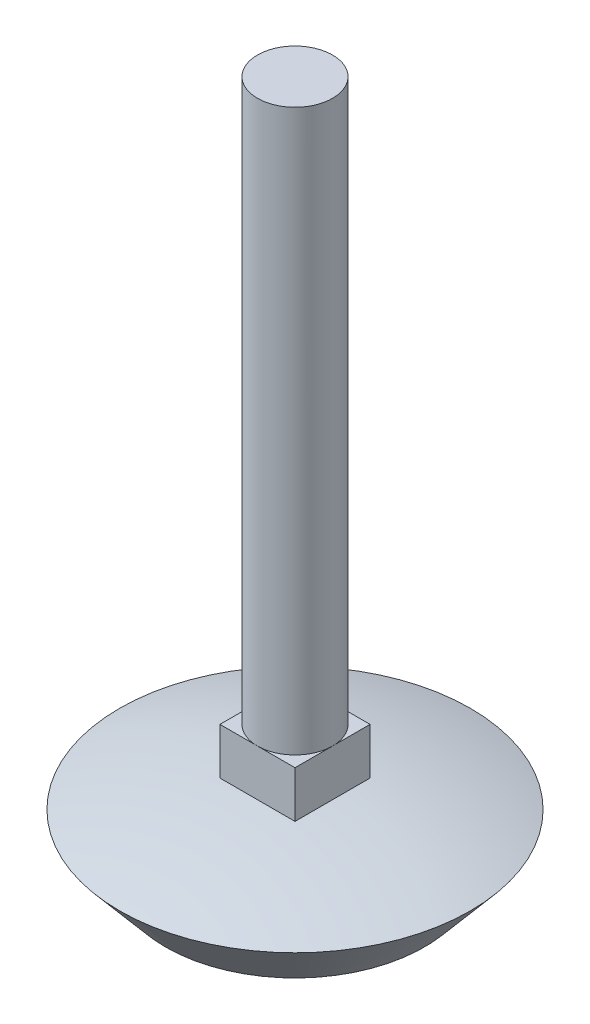
ISO-10303-21;
HEADER;
FILE_DESCRIPTION(('STEP AP214'),'2;1');
FILE_NAME('part.step','',(''),(''),'','','');
FILE_SCHEMA(('AUTOMOTIVE_DESIGN { 1 0 10303 214 1 1 1 1 }'));
ENDSEC;
DATA;
#1=APPLICATION_CONTEXT('core data for automotive mechanical design processes');
#2=APPLICATION_PROTOCOL_DEFINITION('international standard','automotive_design',2000,#1);
#3=PRODUCT_CONTEXT('',#1,'mechanical');
#4=PRODUCT('Part','Part','',(#3));
#5=PRODUCT_RELATED_PRODUCT_CATEGORY('part','',(#4));
#6=PRODUCT_DEFINITION_FORMATION('','',#4);
#7=PRODUCT_DEFINITION_CONTEXT('part definition',#1,'design');
#8=PRODUCT_DEFINITION('design','',#6,#7);
#9=PRODUCT_DEFINITION_SHAPE('','',#8);
#10=(LENGTH_UNIT() NAMED_UNIT(*) SI_UNIT(.MILLI.,.METRE.));
#11=(NAMED_UNIT(*) PLANE_ANGLE_UNIT() SI_UNIT($,.RADIAN.));
#12=(NAMED_UNIT(*) SI_UNIT($,.STERADIAN.) SOLID_ANGLE_UNIT());
#13=UNCERTAINTY_MEASURE_WITH_UNIT(LENGTH_MEASURE(1.E-05),#10,'distance_accuracy_value','');
#14=(GEOMETRIC_REPRESENTATION_CONTEXT(3) GLOBAL_UNCERTAINTY_ASSIGNED_CONTEXT((#13)) GLOBAL_UNIT_ASSIGNED_CONTEXT((#10,
#11,#12)) REPRESENTATION_CONTEXT('',''));
#15=CARTESIAN_POINT('',(0.,0.,0.));
#16=DIRECTION('',(0.,0.,1.));
#17=DIRECTION('',(1.,0.,0.));
#18=AXIS2_PLACEMENT_3D('',#15,#16,#17);
#19=CARTESIAN_POINT('',(152.400000006924,794.888474618777,0.));
#20=DIRECTION('',(0.,1.,0.));
#21=DIRECTION('',(-1.,0.,0.));
#22=AXIS2_PLACEMENT_3D('',#19,#20,#21);
#23=SPHERICAL_SURFACE('',#22,68.8702857354274);
#24=CARTESIAN_POINT('',(152.4,860.20276035304,0.));
#25=DIRECTION('',(0.,1.,0.));
#26=DIRECTION('',(0.,0.,1.));
#27=AXIS2_PLACEMENT_3D('',#24,#25,#26);
#28=CIRCLE('',#27,21.844);
#29=CARTESIAN_POINT('',(152.4,860.20276035304,21.844));
#30=VERTEX_POINT('',#29);
#31=EDGE_CURVE('E135',#30,#30,#28,.T.);
#32=ORIENTED_EDGE('',*,*,#31,.T.);
#33=EDGE_LOOP('',(#32));
#34=FACE_BOUND('',#33,.T.);
#35=CARTESIAN_POINT('',(152.4,863.600000000368,0.));
#36=DIRECTION('',(0.,1.,0.));
#37=DIRECTION('',(0.,0.,1.));
#38=AXIS2_PLACEMENT_3D('',#35,#36,#37);
#39=CIRCLE('',#38,4.67359999890013);
#40=CARTESIAN_POINT('',(152.4,863.600000000602,4.6736));
#41=VERTEX_POINT('',#40);
#42=CARTESIAN_POINT('',(157.0735999989,863.600000000368,0.));
#43=VERTEX_POINT('',#42);
#44=EDGE_CURVE('E120',#41,#43,#39,.T.);
#45=ORIENTED_EDGE('',*,*,#44,.F.);
#46=CARTESIAN_POINT('',(147.7264000011,863.600000000368,0.));
#47=VERTEX_POINT('',#46);
#48=EDGE_CURVE('E54',#47,#41,#39,.T.);
#49=ORIENTED_EDGE('',*,*,#48,.F.);
#50=CARTESIAN_POINT('',(152.4,863.600000000368,-4.67359999890013));
#51=VERTEX_POINT('',#50);
#52=EDGE_CURVE('E124',#51,#47,#39,.T.);
#53=ORIENTED_EDGE('',*,*,#52,.F.);
#54=EDGE_CURVE('E130',#43,#51,#39,.T.);
#55=ORIENTED_EDGE('',*,*,#54,.F.);
#56=EDGE_LOOP('',(#45,#49,#53,#55));
#57=FACE_BOUND('',#56,.T.);
#58=ADVANCED_FACE('F31',(#34,#57),#23,.T.);
#59=CARTESIAN_POINT('',(152.4,860.20276035304,0.));
#60=DIRECTION('',(0.,1.,0.));
#61=DIRECTION('',(0.,0.,1.));
#62=AXIS2_PLACEMENT_3D('',#59,#60,#61);
#63=CONICAL_SURFACE('',#62,21.844,0.701624464926902);
#64=CARTESIAN_POINT('',(152.4,853.44,0.));
#65=DIRECTION('',(0.,1.,0.));
#66=DIRECTION('',(0.,0.,1.));
#67=AXIS2_PLACEMENT_3D('',#64,#65,#66);
#68=CIRCLE('',#67,16.129);
#69=CARTESIAN_POINT('',(152.4,853.44,16.129));
#70=VERTEX_POINT('',#69);
#71=EDGE_CURVE('E133',#70,#70,#68,.T.);
#72=ORIENTED_EDGE('',*,*,#71,.T.);
#73=EDGE_LOOP('',(#72));
#74=FACE_BOUND('',#73,.T.);
#75=ORIENTED_EDGE('',*,*,#31,.F.);
#76=EDGE_LOOP('',(#75));
#77=FACE_BOUND('',#76,.T.);
#78=ADVANCED_FACE('F207',(#74,#77),#63,.T.);
#79=CARTESIAN_POINT('',(152.4,853.44,0.));
#80=DIRECTION('',(0.,-1.,0.));
#81=DIRECTION('',(0.,0.,-1.));
#82=AXIS2_PLACEMENT_3D('',#79,#80,#81);
#83=PLANE('',#82);
#84=ORIENTED_EDGE('',*,*,#71,.F.);
#85=EDGE_LOOP('',(#84));
#86=FACE_BOUND('',#85,.T.);
#87=ADVANCED_FACE('F203',(#86),#83,.T.);
#88=CARTESIAN_POINT('',(147.7264000011,863.600000000368,4.6736));
#89=DIRECTION('',(-5.01591046581465E-11,1.,0.));
#90=DIRECTION('',(-1.,-5.01591046581465E-11,0.));
#91=AXIS2_PLACEMENT_3D('',#88,#89,#90);
#92=PLANE('',#91);
#93=ORIENTED_EDGE('',*,*,#52,.T.);
#94=DIRECTION('',(0.,0.,-1.));
#95=VECTOR('',#94,1.);
#96=CARTESIAN_POINT('',(147.7264000011,863.600000000368,4.6736));
#97=LINE('',#96,#95);
#98=CARTESIAN_POINT('',(147.7264000011,863.600000000368,-4.6736));
#99=VERTEX_POINT('',#98);
#100=EDGE_CURVE('E170',#47,#99,#97,.T.);
#101=ORIENTED_EDGE('',*,*,#100,.T.);
#102=DIRECTION('',(1.,5.01591046581465E-11,0.));
#103=VECTOR('',#102,1.);
#104=CARTESIAN_POINT('',(147.7264000011,863.600000000368,-4.6736));
#105=LINE('',#104,#103);
#106=EDGE_CURVE('E176',#99,#51,#105,.T.);
#107=ORIENTED_EDGE('',*,*,#106,.T.);
#108=EDGE_LOOP('',(#93,#101,#107));
#109=FACE_BOUND('',#108,.T.);
#110=ADVANCED_FACE('F189',(#109),#92,.F.);
#111=ORIENTED_EDGE('',*,*,#54,.T.);
#112=CARTESIAN_POINT('',(157.073600005856,863.600000000837,-4.6736));
#113=VERTEX_POINT('',#112);
#114=EDGE_CURVE('E179',#51,#113,#105,.T.);
#115=ORIENTED_EDGE('',*,*,#114,.T.);
#116=DIRECTION('',(0.,0.,-1.));
#117=VECTOR('',#116,1.);
#118=CARTESIAN_POINT('',(157.073600005856,863.600000000837,4.6736));
#119=LINE('',#118,#117);
#120=EDGE_CURVE('E122',#43,#113,#119,.T.);
#121=ORIENTED_EDGE('',*,*,#120,.F.);
#122=EDGE_LOOP('',(#111,#115,#121));
#123=FACE_BOUND('',#122,.T.);
#124=ADVANCED_FACE('F202',(#123),#92,.F.);
#125=ORIENTED_EDGE('',*,*,#44,.T.);
#126=CARTESIAN_POINT('',(157.073600005856,863.600000000837,4.6736));
#127=VERTEX_POINT('',#126);
#128=EDGE_CURVE('E113',#127,#43,#119,.T.);
#129=ORIENTED_EDGE('',*,*,#128,.F.);
#130=DIRECTION('',(1.,5.01591046581465E-11,0.));
#131=VECTOR('',#130,1.);
#132=CARTESIAN_POINT('',(147.7264000011,863.600000000368,4.6736));
#133=LINE('',#132,#131);
#134=EDGE_CURVE('E96',#41,#127,#133,.T.);
#135=ORIENTED_EDGE('',*,*,#134,.F.);
#136=EDGE_LOOP('',(#125,#129,#135));
#137=FACE_BOUND('',#136,.T.);
#138=ADVANCED_FACE('F119',(#137),#92,.F.);
#139=CARTESIAN_POINT('',(157.073600005856,863.600000000837,4.6736));
#140=DIRECTION('',(-1.,-1.2011312576063E-09,0.));
#141=DIRECTION('',(1.2011312576063E-09,-1.,0.));
#142=AXIS2_PLACEMENT_3D('',#139,#140,#141);
#143=PLANE('',#142);
#144=DIRECTION('',(0.,0.,-1.));
#145=VECTOR('',#144,1.);
#146=CARTESIAN_POINT('',(157.0735999989,869.391200000368,4.6736));
#147=LINE('',#146,#145);
#148=CARTESIAN_POINT('',(157.0735999989,869.391200000368,0.));
#149=VERTEX_POINT('',#148);
#150=CARTESIAN_POINT('',(157.0735999989,869.391200000368,-4.6736));
#151=VERTEX_POINT('',#150);
#152=EDGE_CURVE('E166',#149,#151,#147,.T.);
#153=ORIENTED_EDGE('',*,*,#152,.F.);
#154=CARTESIAN_POINT('',(157.0735999989,869.391200000368,4.6736));
#155=VERTEX_POINT('',#154);
#156=EDGE_CURVE('E115',#155,#149,#147,.T.);
#157=ORIENTED_EDGE('',*,*,#156,.F.);
#158=DIRECTION('',(-1.2011312576063E-09,1.,0.));
#159=VECTOR('',#158,1.);
#160=CARTESIAN_POINT('',(157.073600005856,863.600000000837,4.6736));
#161=LINE('',#160,#159);
#162=EDGE_CURVE('E100',#127,#155,#161,.T.);
#163=ORIENTED_EDGE('',*,*,#162,.F.);
#164=ORIENTED_EDGE('',*,*,#128,.T.);
#165=ORIENTED_EDGE('',*,*,#120,.T.);
#166=DIRECTION('',(-1.2011312576063E-09,1.,0.));
#167=VECTOR('',#166,1.);
#168=CARTESIAN_POINT('',(157.073600005856,863.600000000837,-4.6736));
#169=LINE('',#168,#167);
#170=EDGE_CURVE('E173',#113,#151,#169,.T.);
#171=ORIENTED_EDGE('',*,*,#170,.T.);
#172=EDGE_LOOP('',(#153,#157,#163,#164,#165,#171));
#173=FACE_BOUND('',#172,.T.);
#174=ADVANCED_FACE('F112',(#173),#143,.F.);
#175=CARTESIAN_POINT('',(157.0735999989,869.391200000368,4.6736));
#176=DIRECTION('',(0.,-1.,0.));
#177=DIRECTION('',(0.,0.,-1.));
#178=AXIS2_PLACEMENT_3D('',#175,#176,#177);
#179=PLANE('',#178);
#180=CARTESIAN_POINT('',(152.4,869.391200000368,0.));
#181=DIRECTION('',(0.,-1.,0.));
#182=DIRECTION('',(0.,0.,-1.));
#183=AXIS2_PLACEMENT_3D('',#180,#181,#182);
#184=CIRCLE('',#183,4.67359999890013);
#185=CARTESIAN_POINT('',(152.4,869.391200000368,-4.67359999945007));
#186=VERTEX_POINT('',#185);
#187=CARTESIAN_POINT('',(147.7264000011,869.391200000368,0.));
#188=VERTEX_POINT('',#187);
#189=EDGE_CURVE('E11',#186,#188,#184,.F.);
#190=ORIENTED_EDGE('',*,*,#189,.F.);
#191=DIRECTION('',(-1.,0.,0.));
#192=VECTOR('',#191,1.);
#193=CARTESIAN_POINT('',(157.0735999989,869.391200000368,-4.6736));
#194=LINE('',#193,#192);
#195=CARTESIAN_POINT('',(147.7264000011,869.391200000368,-4.6736));
#196=VERTEX_POINT('',#195);
#197=EDGE_CURVE('E158',#186,#196,#194,.T.);
#198=ORIENTED_EDGE('',*,*,#197,.T.);
#199=DIRECTION('',(0.,0.,-1.));
#200=VECTOR('',#199,1.);
#201=CARTESIAN_POINT('',(147.7264000011,869.391200000368,4.6736));
#202=LINE('',#201,#200);
#203=EDGE_CURVE('E156',#188,#196,#202,.T.);
#204=ORIENTED_EDGE('',*,*,#203,.F.);
#205=EDGE_LOOP('',(#190,#198,#204));
#206=FACE_BOUND('',#205,.T.);
#207=ADVANCED_FACE('F157',(#206),#179,.F.);
#208=CARTESIAN_POINT('',(152.4,869.391200000368,4.6736));
#209=VERTEX_POINT('',#208);
#210=EDGE_CURVE('E39',#188,#209,#184,.F.);
#211=ORIENTED_EDGE('',*,*,#210,.F.);
#212=CARTESIAN_POINT('',(147.7264000011,869.391200000368,4.6736));
#213=VERTEX_POINT('',#212);
#214=EDGE_CURVE('E152',#213,#188,#202,.T.);
#215=ORIENTED_EDGE('',*,*,#214,.F.);
#216=DIRECTION('',(-1.,0.,0.));
#217=VECTOR('',#216,1.);
#218=CARTESIAN_POINT('',(157.0735999989,869.391200000368,4.6736));
#219=LINE('',#218,#217);
#220=EDGE_CURVE('E117',#209,#213,#219,.T.);
#221=ORIENTED_EDGE('',*,*,#220,.F.);
#222=EDGE_LOOP('',(#211,#215,#221));
#223=FACE_BOUND('',#222,.T.);
#224=ADVANCED_FACE('F150',(#223),#179,.F.);
#225=EDGE_CURVE('E140',#209,#149,#184,.F.);
#226=ORIENTED_EDGE('',*,*,#225,.F.);
#227=EDGE_CURVE('E181',#155,#209,#219,.T.);
#228=ORIENTED_EDGE('',*,*,#227,.F.);
#229=ORIENTED_EDGE('',*,*,#156,.T.);
#230=EDGE_LOOP('',(#226,#228,#229));
#231=FACE_BOUND('',#230,.T.);
#232=ADVANCED_FACE('F196',(#231),#179,.F.);
#233=CARTESIAN_POINT('',(147.7264000011,869.391200000368,4.6736));
#234=DIRECTION('',(1.,0.,0.));
#235=DIRECTION('',(0.,1.,0.));
#236=AXIS2_PLACEMENT_3D('',#233,#234,#235);
#237=PLANE('',#236);
#238=ORIENTED_EDGE('',*,*,#214,.T.);
#239=ORIENTED_EDGE('',*,*,#203,.T.);
#240=DIRECTION('',(0.,-1.,0.));
#241=VECTOR('',#240,1.);
#242=CARTESIAN_POINT('',(147.7264000011,869.391200000368,-4.6736));
#243=LINE('',#242,#241);
#244=EDGE_CURVE('E107',#196,#99,#243,.T.);
#245=ORIENTED_EDGE('',*,*,#244,.T.);
#246=ORIENTED_EDGE('',*,*,#100,.F.);
#247=CARTESIAN_POINT('',(147.7264000011,863.600000000368,4.6736));
#248=VERTEX_POINT('',#247);
#249=EDGE_CURVE('E162',#248,#47,#97,.T.);
#250=ORIENTED_EDGE('',*,*,#249,.F.);
#251=DIRECTION('',(0.,-1.,0.));
#252=VECTOR('',#251,1.);
#253=CARTESIAN_POINT('',(147.7264000011,869.391200000368,4.6736));
#254=LINE('',#253,#252);
#255=EDGE_CURVE('E165',#213,#248,#254,.T.);
#256=ORIENTED_EDGE('',*,*,#255,.F.);
#257=EDGE_LOOP('',(#238,#239,#245,#246,#250,#256));
#258=FACE_BOUND('',#257,.T.);
#259=ADVANCED_FACE('F163',(#258),#237,.F.);
#260=CARTESIAN_POINT('',(147.7264000011,863.600000000368,4.6736));
#261=DIRECTION('',(0.,0.,-1.));
#262=DIRECTION('',(-1.,0.,0.));
#263=AXIS2_PLACEMENT_3D('',#260,#261,#262);
#264=PLANE('',#263);
#265=ORIENTED_EDGE('',*,*,#227,.T.);
#266=ORIENTED_EDGE('',*,*,#220,.T.);
#267=ORIENTED_EDGE('',*,*,#255,.T.);
#268=EDGE_CURVE('E103',#248,#41,#133,.T.);
#269=ORIENTED_EDGE('',*,*,#268,.T.);
#270=ORIENTED_EDGE('',*,*,#134,.T.);
#271=ORIENTED_EDGE('',*,*,#162,.T.);
#272=EDGE_LOOP('',(#265,#266,#267,#269,#270,#271));
#273=FACE_BOUND('',#272,.T.);
#274=ADVANCED_FACE('F99',(#273),#264,.F.);
#275=CARTESIAN_POINT('',(147.7264000011,863.600000000368,-4.6736));
#276=DIRECTION('',(0.,0.,-1.));
#277=DIRECTION('',(-1.,0.,0.));
#278=AXIS2_PLACEMENT_3D('',#275,#276,#277);
#279=PLANE('',#278);
#280=ORIENTED_EDGE('',*,*,#114,.F.);
#281=ORIENTED_EDGE('',*,*,#106,.F.);
#282=ORIENTED_EDGE('',*,*,#244,.F.);
#283=ORIENTED_EDGE('',*,*,#197,.F.);
#284=EDGE_CURVE('E46',#151,#186,#194,.T.);
#285=ORIENTED_EDGE('',*,*,#284,.F.);
#286=ORIENTED_EDGE('',*,*,#170,.F.);
#287=EDGE_LOOP('',(#280,#281,#282,#283,#285,#286));
#288=FACE_BOUND('',#287,.T.);
#289=ADVANCED_FACE('F187',(#288),#279,.T.);
#290=ORIENTED_EDGE('',*,*,#48,.T.);
#291=ORIENTED_EDGE('',*,*,#268,.F.);
#292=ORIENTED_EDGE('',*,*,#249,.T.);
#293=EDGE_LOOP('',(#290,#291,#292));
#294=FACE_BOUND('',#293,.T.);
#295=ADVANCED_FACE('F184',(#294),#92,.F.);
#296=EDGE_CURVE('E34',#149,#186,#184,.F.);
#297=ORIENTED_EDGE('',*,*,#296,.F.);
#298=ORIENTED_EDGE('',*,*,#152,.T.);
#299=ORIENTED_EDGE('',*,*,#284,.T.);
#300=EDGE_LOOP('',(#297,#298,#299));
#301=FACE_BOUND('',#300,.T.);
#302=ADVANCED_FACE('F186',(#301),#179,.F.);
#303=CARTESIAN_POINT('',(152.4,939.241200000368,0.));
#304=DIRECTION('',(0.,1.,0.));
#305=DIRECTION('',(0.,0.,1.));
#306=AXIS2_PLACEMENT_3D('',#303,#304,#305);
#307=PLANE('',#306);
#308=CARTESIAN_POINT('',(152.4,939.241200000368,0.));
#309=DIRECTION('',(0.,1.,0.));
#310=DIRECTION('',(0.,0.,1.));
#311=AXIS2_PLACEMENT_3D('',#308,#309,#310);
#312=CIRCLE('',#311,4.67359999890013);
#313=CARTESIAN_POINT('',(152.4,939.241200000368,4.67359999890013));
#314=VERTEX_POINT('',#313);
#315=EDGE_CURVE('E129',#314,#314,#312,.T.);
#316=ORIENTED_EDGE('',*,*,#315,.T.);
#317=EDGE_LOOP('',(#316));
#318=FACE_BOUND('',#317,.T.);
#319=ADVANCED_FACE('F194',(#318),#307,.T.);
#320=CARTESIAN_POINT('',(152.4,939.241200000368,0.));
#321=DIRECTION('',(0.,1.,0.));
#322=DIRECTION('',(0.,0.,1.));
#323=AXIS2_PLACEMENT_3D('',#320,#321,#322);
#324=CYLINDRICAL_SURFACE('',#323,4.67359999890013);
#325=ORIENTED_EDGE('',*,*,#315,.F.);
#326=EDGE_LOOP('',(#325));
#327=FACE_BOUND('',#326,.T.);
#328=ORIENTED_EDGE('',*,*,#296,.T.);
#329=ORIENTED_EDGE('',*,*,#189,.T.);
#330=ORIENTED_EDGE('',*,*,#210,.T.);
#331=ORIENTED_EDGE('',*,*,#225,.T.);
#332=EDGE_LOOP('',(#328,#329,#330,#331));
#333=FACE_BOUND('',#332,.T.);
#334=ADVANCED_FACE('F144',(#327,#333),#324,.T.);
#335=CLOSED_SHELL('',(#58,#78,#87,#110,#124,#138,#174,#207,#224,#232,#259,#274,#289,#295,#302,
#319,#334));
#336=MANIFOLD_SOLID_BREP('B2',#335);
#337=ADVANCED_BREP_SHAPE_REPRESENTATION('',(#18,#336),#14);
#338=SHAPE_DEFINITION_REPRESENTATION(#9,#337);
ENDSEC;
END-ISO-10303-21;
